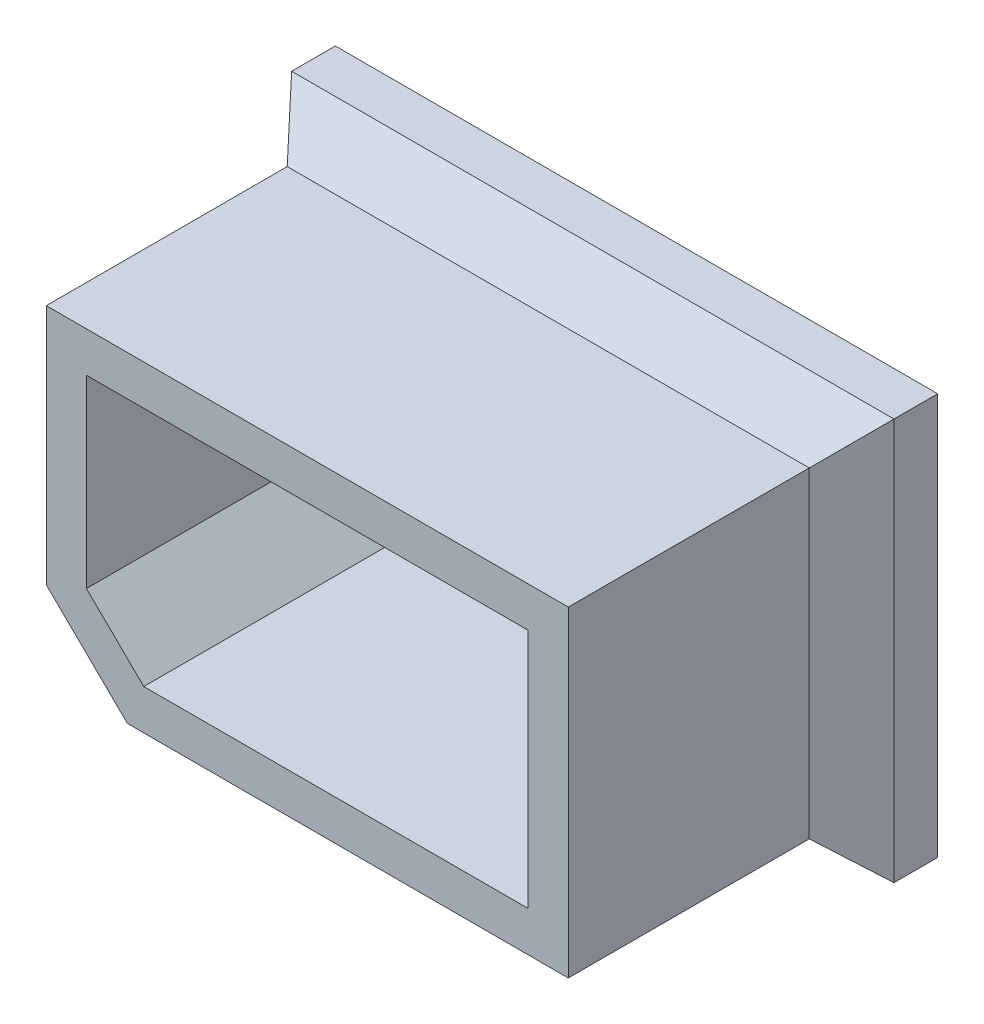
ISO-10303-21;
HEADER;
FILE_DESCRIPTION(('STEP AP214'),'2;1');
FILE_NAME('part.step','',(''),(''),'','','');
FILE_SCHEMA(('AUTOMOTIVE_DESIGN { 1 0 10303 214 1 1 1 1 }'));
ENDSEC;
DATA;
#1=APPLICATION_CONTEXT('core data for automotive mechanical design processes');
#2=APPLICATION_PROTOCOL_DEFINITION('international standard','automotive_design',2000,#1);
#3=PRODUCT_CONTEXT('',#1,'mechanical');
#4=PRODUCT('Part','Part','',(#3));
#5=PRODUCT_RELATED_PRODUCT_CATEGORY('part','',(#4));
#6=PRODUCT_DEFINITION_FORMATION('','',#4);
#7=PRODUCT_DEFINITION_CONTEXT('part definition',#1,'design');
#8=PRODUCT_DEFINITION('design','',#6,#7);
#9=PRODUCT_DEFINITION_SHAPE('','',#8);
#10=(LENGTH_UNIT() NAMED_UNIT(*) SI_UNIT(.MILLI.,.METRE.));
#11=(NAMED_UNIT(*) PLANE_ANGLE_UNIT() SI_UNIT($,.RADIAN.));
#12=(NAMED_UNIT(*) SI_UNIT($,.STERADIAN.) SOLID_ANGLE_UNIT());
#13=UNCERTAINTY_MEASURE_WITH_UNIT(LENGTH_MEASURE(1.E-05),#10,'distance_accuracy_value','');
#14=(GEOMETRIC_REPRESENTATION_CONTEXT(3) GLOBAL_UNCERTAINTY_ASSIGNED_CONTEXT((#13)) GLOBAL_UNIT_ASSIGNED_CONTEXT((#10,
#11,#12)) REPRESENTATION_CONTEXT('',''));
#15=CARTESIAN_POINT('',(0.,0.,0.));
#16=DIRECTION('',(0.,0.,1.));
#17=DIRECTION('',(1.,0.,0.));
#18=AXIS2_PLACEMENT_3D('',#15,#16,#17);
#19=CARTESIAN_POINT('',(0.,0.,0.));
#20=DIRECTION('',(0.,0.,-1.));
#21=DIRECTION('',(-1.,0.,0.));
#22=AXIS2_PLACEMENT_3D('',#19,#20,#21);
#23=PLANE('',#22);
#24=DIRECTION('',(0.,1.,0.));
#25=VECTOR('',#24,1.);
#26=CARTESIAN_POINT('',(82.55,0.,0.));
#27=LINE('',#26,#25);
#28=CARTESIAN_POINT('',(82.55,0.,0.));
#29=VERTEX_POINT('',#28);
#30=CARTESIAN_POINT('',(82.55,50.8,0.));
#31=VERTEX_POINT('',#30);
#32=EDGE_CURVE('E210',#29,#31,#27,.T.);
#33=ORIENTED_EDGE('',*,*,#32,.T.);
#34=DIRECTION('',(-1.,0.,0.));
#35=VECTOR('',#34,1.);
#36=CARTESIAN_POINT('',(0.,50.8,0.));
#37=LINE('',#36,#35);
#38=CARTESIAN_POINT('',(0.,50.8,0.));
#39=VERTEX_POINT('',#38);
#40=EDGE_CURVE('E212',#31,#39,#37,.T.);
#41=ORIENTED_EDGE('',*,*,#40,.T.);
#42=DIRECTION('',(0.,-1.,0.));
#43=VECTOR('',#42,1.);
#44=CARTESIAN_POINT('',(0.,0.,0.));
#45=LINE('',#44,#43);
#46=CARTESIAN_POINT('',(0.,0.,0.));
#47=VERTEX_POINT('',#46);
#48=EDGE_CURVE('E206',#39,#47,#45,.T.);
#49=ORIENTED_EDGE('',*,*,#48,.T.);
#50=DIRECTION('',(1.,0.,0.));
#51=VECTOR('',#50,1.);
#52=CARTESIAN_POINT('',(0.,0.,0.));
#53=LINE('',#52,#51);
#54=EDGE_CURVE('E208',#47,#29,#53,.T.);
#55=ORIENTED_EDGE('',*,*,#54,.T.);
#56=EDGE_LOOP('',(#33,#41,#49,#55));
#57=FACE_BOUND('',#56,.T.);
#58=DIRECTION('',(1.,0.,0.));
#59=VECTOR('',#58,1.);
#60=CARTESIAN_POINT('',(76.2,44.45,0.));
#61=LINE('',#60,#59);
#62=CARTESIAN_POINT('',(6.35,44.45,0.));
#63=VERTEX_POINT('',#62);
#64=CARTESIAN_POINT('',(76.2,44.45,0.));
#65=VERTEX_POINT('',#64);
#66=EDGE_CURVE('E173',#63,#65,#61,.T.);
#67=ORIENTED_EDGE('',*,*,#66,.T.);
#68=DIRECTION('',(0.,-1.,0.));
#69=VECTOR('',#68,1.);
#70=CARTESIAN_POINT('',(76.2,6.35,0.));
#71=LINE('',#70,#69);
#72=CARTESIAN_POINT('',(76.2,6.35,0.));
#73=VERTEX_POINT('',#72);
#74=EDGE_CURVE('E176',#65,#73,#71,.T.);
#75=ORIENTED_EDGE('',*,*,#74,.T.);
#76=DIRECTION('',(-1.,0.,0.));
#77=VECTOR('',#76,1.);
#78=CARTESIAN_POINT('',(15.4196141042494,6.35,0.));
#79=LINE('',#78,#77);
#80=CARTESIAN_POINT('',(15.4196141042494,6.35,0.));
#81=VERTEX_POINT('',#80);
#82=EDGE_CURVE('E179',#73,#81,#79,.T.);
#83=ORIENTED_EDGE('',*,*,#82,.T.);
#84=DIRECTION('',(-0.714142842854285,0.7,0.));
#85=VECTOR('',#84,1.);
#86=CARTESIAN_POINT('',(6.34999999999999,15.24,0.));
#87=LINE('',#86,#85);
#88=CARTESIAN_POINT('',(6.34999999999999,15.24,0.));
#89=VERTEX_POINT('',#88);
#90=EDGE_CURVE('E182',#81,#89,#87,.T.);
#91=ORIENTED_EDGE('',*,*,#90,.T.);
#92=DIRECTION('',(0.,1.,0.));
#93=VECTOR('',#92,1.);
#94=CARTESIAN_POINT('',(6.35,44.45,0.));
#95=LINE('',#94,#93);
#96=EDGE_CURVE('E160',#89,#63,#95,.T.);
#97=ORIENTED_EDGE('',*,*,#96,.T.);
#98=EDGE_LOOP('',(#67,#75,#83,#91,#97));
#99=FACE_BOUND('',#98,.T.);
#100=ADVANCED_FACE('F43',(#57,#99),#23,.F.);
#101=CARTESIAN_POINT('',(-6.34999999999999,57.15,-12.7));
#102=DIRECTION('',(0.,-1.,0.));
#103=DIRECTION('',(1.,0.,0.));
#104=AXIS2_PLACEMENT_3D('',#101,#102,#103);
#105=PLANE('',#104);
#106=DIRECTION('',(0.,0.,1.));
#107=VECTOR('',#106,1.);
#108=CARTESIAN_POINT('',(-6.34999999999999,57.15,-12.7));
#109=LINE('',#108,#107);
#110=CARTESIAN_POINT('',(-6.34999999999998,57.15,-13.97));
#111=VERTEX_POINT('',#110);
#112=CARTESIAN_POINT('',(-6.34999999999999,57.15,-7.05238946916537));
#113=VERTEX_POINT('',#112);
#114=EDGE_CURVE('E198',#111,#113,#109,.T.);
#115=ORIENTED_EDGE('',*,*,#114,.T.);
#116=DIRECTION('',(1.,0.,0.));
#117=VECTOR('',#116,1.);
#118=CARTESIAN_POINT('',(-6.34999999999999,57.15,-7.05238946916537));
#119=LINE('',#118,#117);
#120=CARTESIAN_POINT('',(88.9,57.15,-7.05238946916537));
#121=VERTEX_POINT('',#120);
#122=EDGE_CURVE('E203',#113,#121,#119,.T.);
#123=ORIENTED_EDGE('',*,*,#122,.T.);
#124=DIRECTION('',(0.,0.,1.));
#125=VECTOR('',#124,1.);
#126=CARTESIAN_POINT('',(88.9,57.15,-12.7));
#127=LINE('',#126,#125);
#128=CARTESIAN_POINT('',(88.9,57.15,-13.97));
#129=VERTEX_POINT('',#128);
#130=EDGE_CURVE('E130',#129,#121,#127,.T.);
#131=ORIENTED_EDGE('',*,*,#130,.F.);
#132=DIRECTION('',(1.,0.,0.));
#133=VECTOR('',#132,1.);
#134=CARTESIAN_POINT('',(-6.34999999999998,57.15,-13.97));
#135=LINE('',#134,#133);
#136=EDGE_CURVE('E145',#111,#129,#135,.T.);
#137=ORIENTED_EDGE('',*,*,#136,.F.);
#138=EDGE_LOOP('',(#115,#123,#131,#137));
#139=FACE_BOUND('',#138,.T.);
#140=ADVANCED_FACE('F242',(#139),#105,.F.);
#141=CARTESIAN_POINT('',(88.9,57.15,-12.7));
#142=DIRECTION('',(-1.,0.,0.));
#143=DIRECTION('',(0.,-1.,0.));
#144=AXIS2_PLACEMENT_3D('',#141,#142,#143);
#145=PLANE('',#144);
#146=ORIENTED_EDGE('',*,*,#130,.T.);
#147=DIRECTION('',(0.,-1.,0.));
#148=VECTOR('',#147,1.);
#149=CARTESIAN_POINT('',(88.9,57.15,-7.05238946916537));
#150=LINE('',#149,#148);
#151=CARTESIAN_POINT('',(88.9,-6.35000000000002,-7.05238946916537));
#152=VERTEX_POINT('',#151);
#153=EDGE_CURVE('E67',#121,#152,#150,.T.);
#154=ORIENTED_EDGE('',*,*,#153,.T.);
#155=DIRECTION('',(0.,0.,1.));
#156=VECTOR('',#155,1.);
#157=CARTESIAN_POINT('',(88.9,-6.35000000000002,-12.7));
#158=LINE('',#157,#156);
#159=CARTESIAN_POINT('',(88.9,-6.35000000000002,-13.97));
#160=VERTEX_POINT('',#159);
#161=EDGE_CURVE('E125',#160,#152,#158,.T.);
#162=ORIENTED_EDGE('',*,*,#161,.F.);
#163=DIRECTION('',(0.,-1.,0.));
#164=VECTOR('',#163,1.);
#165=CARTESIAN_POINT('',(88.9,57.15,-13.97));
#166=LINE('',#165,#164);
#167=EDGE_CURVE('E129',#129,#160,#166,.T.);
#168=ORIENTED_EDGE('',*,*,#167,.F.);
#169=EDGE_LOOP('',(#146,#154,#162,#168));
#170=FACE_BOUND('',#169,.T.);
#171=ADVANCED_FACE('F127',(#170),#145,.F.);
#172=CARTESIAN_POINT('',(88.9,-6.35000000000002,-12.7));
#173=DIRECTION('',(0.,1.,0.));
#174=DIRECTION('',(0.,0.,1.));
#175=AXIS2_PLACEMENT_3D('',#172,#173,#174);
#176=PLANE('',#175);
#177=ORIENTED_EDGE('',*,*,#161,.T.);
#178=DIRECTION('',(-1.,0.,0.));
#179=VECTOR('',#178,1.);
#180=CARTESIAN_POINT('',(88.9,-6.35000000000002,-7.05238946916537));
#181=LINE('',#180,#179);
#182=CARTESIAN_POINT('',(-6.34999999999999,-6.35000000000002,-7.05238946916537));
#183=VERTEX_POINT('',#182);
#184=EDGE_CURVE('E52',#152,#183,#181,.T.);
#185=ORIENTED_EDGE('',*,*,#184,.T.);
#186=DIRECTION('',(0.,0.,1.));
#187=VECTOR('',#186,1.);
#188=CARTESIAN_POINT('',(-6.34999999999999,-6.35000000000002,-12.7));
#189=LINE('',#188,#187);
#190=CARTESIAN_POINT('',(-6.34999999999998,-6.35000000000002,-13.97));
#191=VERTEX_POINT('',#190);
#192=EDGE_CURVE('E131',#191,#183,#189,.T.);
#193=ORIENTED_EDGE('',*,*,#192,.F.);
#194=DIRECTION('',(-1.,0.,0.));
#195=VECTOR('',#194,1.);
#196=CARTESIAN_POINT('',(-6.34999999999998,-6.35000000000002,-13.97));
#197=LINE('',#196,#195);
#198=EDGE_CURVE('E134',#160,#191,#197,.T.);
#199=ORIENTED_EDGE('',*,*,#198,.F.);
#200=EDGE_LOOP('',(#177,#185,#193,#199));
#201=FACE_BOUND('',#200,.T.);
#202=ADVANCED_FACE('F135',(#201),#176,.F.);
#203=CARTESIAN_POINT('',(-6.34999999999999,-6.35000000000002,-12.7));
#204=DIRECTION('',(1.,0.,0.));
#205=DIRECTION('',(0.,0.,-1.));
#206=AXIS2_PLACEMENT_3D('',#203,#204,#205);
#207=PLANE('',#206);
#208=ORIENTED_EDGE('',*,*,#192,.T.);
#209=DIRECTION('',(0.,1.,0.));
#210=VECTOR('',#209,1.);
#211=CARTESIAN_POINT('',(-6.34999999999999,-6.35000000000002,-7.05238946916537));
#212=LINE('',#211,#210);
#213=EDGE_CURVE('E12',#183,#113,#212,.T.);
#214=ORIENTED_EDGE('',*,*,#213,.T.);
#215=ORIENTED_EDGE('',*,*,#114,.F.);
#216=DIRECTION('',(0.,1.,0.));
#217=VECTOR('',#216,1.);
#218=CARTESIAN_POINT('',(-6.34999999999998,57.15,-13.97));
#219=LINE('',#218,#217);
#220=EDGE_CURVE('E139',#191,#111,#219,.T.);
#221=ORIENTED_EDGE('',*,*,#220,.F.);
#222=EDGE_LOOP('',(#208,#214,#215,#221));
#223=FACE_BOUND('',#222,.T.);
#224=ADVANCED_FACE('F244',(#223),#207,.F.);
#225=CARTESIAN_POINT('',(76.2,44.45,-12.7));
#226=DIRECTION('',(0.,-1.,0.));
#227=DIRECTION('',(0.,0.,-1.));
#228=AXIS2_PLACEMENT_3D('',#225,#226,#227);
#229=PLANE('',#228);
#230=ORIENTED_EDGE('',*,*,#66,.F.);
#231=DIRECTION('',(0.,0.,1.));
#232=VECTOR('',#231,1.);
#233=CARTESIAN_POINT('',(6.35,44.45,-12.7));
#234=LINE('',#233,#232);
#235=CARTESIAN_POINT('',(6.35,44.45,-12.7));
#236=VERTEX_POINT('',#235);
#237=EDGE_CURVE('E172',#236,#63,#234,.T.);
#238=ORIENTED_EDGE('',*,*,#237,.F.);
#239=DIRECTION('',(1.,0.,0.));
#240=VECTOR('',#239,1.);
#241=CARTESIAN_POINT('',(76.2,44.45,-12.7));
#242=LINE('',#241,#240);
#243=CARTESIAN_POINT('',(76.2,44.45,-12.7));
#244=VERTEX_POINT('',#243);
#245=EDGE_CURVE('E156',#236,#244,#242,.T.);
#246=ORIENTED_EDGE('',*,*,#245,.T.);
#247=DIRECTION('',(0.,0.,1.));
#248=VECTOR('',#247,1.);
#249=CARTESIAN_POINT('',(76.2,44.45,-12.7));
#250=LINE('',#249,#248);
#251=EDGE_CURVE('E195',#244,#65,#250,.T.);
#252=ORIENTED_EDGE('',*,*,#251,.T.);
#253=EDGE_LOOP('',(#230,#238,#246,#252));
#254=FACE_BOUND('',#253,.T.);
#255=ADVANCED_FACE('F246',(#254),#229,.T.);
#256=CARTESIAN_POINT('',(76.2,6.35,-12.7));
#257=DIRECTION('',(-1.,0.,0.));
#258=DIRECTION('',(0.,-1.,0.));
#259=AXIS2_PLACEMENT_3D('',#256,#257,#258);
#260=PLANE('',#259);
#261=ORIENTED_EDGE('',*,*,#74,.F.);
#262=ORIENTED_EDGE('',*,*,#251,.F.);
#263=DIRECTION('',(0.,-1.,0.));
#264=VECTOR('',#263,1.);
#265=CARTESIAN_POINT('',(76.2,6.35,-12.7));
#266=LINE('',#265,#264);
#267=CARTESIAN_POINT('',(76.2,6.35,-12.7));
#268=VERTEX_POINT('',#267);
#269=EDGE_CURVE('E159',#244,#268,#266,.T.);
#270=ORIENTED_EDGE('',*,*,#269,.T.);
#271=DIRECTION('',(0.,0.,1.));
#272=VECTOR('',#271,1.);
#273=CARTESIAN_POINT('',(76.2,6.35,-12.7));
#274=LINE('',#273,#272);
#275=EDGE_CURVE('E193',#268,#73,#274,.T.);
#276=ORIENTED_EDGE('',*,*,#275,.T.);
#277=EDGE_LOOP('',(#261,#262,#270,#276));
#278=FACE_BOUND('',#277,.T.);
#279=ADVANCED_FACE('F252',(#278),#260,.T.);
#280=CARTESIAN_POINT('',(15.4196141042494,6.35,-12.7));
#281=DIRECTION('',(0.,1.,0.));
#282=DIRECTION('',(0.,0.,1.));
#283=AXIS2_PLACEMENT_3D('',#280,#281,#282);
#284=PLANE('',#283);
#285=ORIENTED_EDGE('',*,*,#82,.F.);
#286=ORIENTED_EDGE('',*,*,#275,.F.);
#287=DIRECTION('',(-1.,0.,0.));
#288=VECTOR('',#287,1.);
#289=CARTESIAN_POINT('',(15.4196141042494,6.35,-12.7));
#290=LINE('',#289,#288);
#291=CARTESIAN_POINT('',(15.4196141042494,6.35,-12.7));
#292=VERTEX_POINT('',#291);
#293=EDGE_CURVE('E163',#268,#292,#290,.T.);
#294=ORIENTED_EDGE('',*,*,#293,.T.);
#295=DIRECTION('',(0.,0.,1.));
#296=VECTOR('',#295,1.);
#297=CARTESIAN_POINT('',(15.4196141042494,6.35,-12.7));
#298=LINE('',#297,#296);
#299=EDGE_CURVE('E191',#292,#81,#298,.T.);
#300=ORIENTED_EDGE('',*,*,#299,.T.);
#301=EDGE_LOOP('',(#285,#286,#294,#300));
#302=FACE_BOUND('',#301,.T.);
#303=ADVANCED_FACE('F265',(#302),#284,.T.);
#304=CARTESIAN_POINT('',(6.34999999999999,15.24,-12.7));
#305=DIRECTION('',(0.7,0.714142842854285,0.));
#306=DIRECTION('',(-0.714142842854285,0.7,0.));
#307=AXIS2_PLACEMENT_3D('',#304,#305,#306);
#308=PLANE('',#307);
#309=ORIENTED_EDGE('',*,*,#90,.F.);
#310=ORIENTED_EDGE('',*,*,#299,.F.);
#311=DIRECTION('',(-0.714142842854285,0.7,0.));
#312=VECTOR('',#311,1.);
#313=CARTESIAN_POINT('',(6.34999999999999,15.24,-12.7));
#314=LINE('',#313,#312);
#315=CARTESIAN_POINT('',(6.34999999999999,15.24,-12.7));
#316=VERTEX_POINT('',#315);
#317=EDGE_CURVE('E166',#292,#316,#314,.T.);
#318=ORIENTED_EDGE('',*,*,#317,.T.);
#319=DIRECTION('',(0.,0.,1.));
#320=VECTOR('',#319,1.);
#321=CARTESIAN_POINT('',(6.34999999999999,15.24,-12.7));
#322=LINE('',#321,#320);
#323=EDGE_CURVE('E189',#316,#89,#322,.T.);
#324=ORIENTED_EDGE('',*,*,#323,.T.);
#325=EDGE_LOOP('',(#309,#310,#318,#324));
#326=FACE_BOUND('',#325,.T.);
#327=ADVANCED_FACE('F269',(#326),#308,.T.);
#328=CARTESIAN_POINT('',(6.35,44.45,-12.7));
#329=DIRECTION('',(1.,0.,0.));
#330=DIRECTION('',(0.,1.,0.));
#331=AXIS2_PLACEMENT_3D('',#328,#329,#330);
#332=PLANE('',#331);
#333=ORIENTED_EDGE('',*,*,#96,.F.);
#334=ORIENTED_EDGE('',*,*,#323,.F.);
#335=DIRECTION('',(0.,1.,0.));
#336=VECTOR('',#335,1.);
#337=CARTESIAN_POINT('',(6.35,44.45,-12.7));
#338=LINE('',#337,#336);
#339=EDGE_CURVE('E169',#316,#236,#338,.T.);
#340=ORIENTED_EDGE('',*,*,#339,.T.);
#341=ORIENTED_EDGE('',*,*,#237,.T.);
#342=EDGE_LOOP('',(#333,#334,#340,#341));
#343=FACE_BOUND('',#342,.T.);
#344=ADVANCED_FACE('F273',(#343),#332,.T.);
#345=CARTESIAN_POINT('',(88.9,-6.35000000000002,-7.05238946916537));
#346=DIRECTION('',(0.,0.743144825477393,-0.669130606358859));
#347=DIRECTION('',(-1.,0.,0.));
#348=AXIS2_PLACEMENT_3D('',#345,#346,#347);
#349=PLANE('',#348);
#350=DIRECTION('',(-0.556117091816005,0.556117091816005,0.617630601881269));
#351=VECTOR('',#350,1.);
#352=CARTESIAN_POINT('',(88.9,-6.35000000000002,-7.05238946916537));
#353=LINE('',#352,#351);
#354=EDGE_CURVE('E219',#29,#152,#353,.F.);
#355=ORIENTED_EDGE('',*,*,#354,.F.);
#356=ORIENTED_EDGE('',*,*,#54,.F.);
#357=DIRECTION('',(0.556117091816005,0.556117091816005,0.617630601881269));
#358=VECTOR('',#357,1.);
#359=CARTESIAN_POINT('',(-6.34999999999999,-6.35000000000002,-7.05238946916537));
#360=LINE('',#359,#358);
#361=EDGE_CURVE('E47',#183,#47,#360,.T.);
#362=ORIENTED_EDGE('',*,*,#361,.F.);
#363=ORIENTED_EDGE('',*,*,#184,.F.);
#364=EDGE_LOOP('',(#355,#356,#362,#363));
#365=FACE_BOUND('',#364,.T.);
#366=ADVANCED_FACE('F45',(#365),#349,.F.);
#367=CARTESIAN_POINT('',(-6.34999999999999,-6.35000000000002,-7.05238946916537));
#368=DIRECTION('',(0.743144825477393,0.,-0.669130606358859));
#369=DIRECTION('',(0.,1.,0.));
#370=AXIS2_PLACEMENT_3D('',#367,#368,#369);
#371=PLANE('',#370);
#372=ORIENTED_EDGE('',*,*,#361,.T.);
#373=ORIENTED_EDGE('',*,*,#48,.F.);
#374=DIRECTION('',(-0.556117091816005,0.556117091816005,-0.617630601881269));
#375=VECTOR('',#374,1.);
#376=CARTESIAN_POINT('',(13.2884049579281,37.5115950420719,14.7582688483932));
#377=LINE('',#376,#375);
#378=EDGE_CURVE('E218',#113,#39,#377,.F.);
#379=ORIENTED_EDGE('',*,*,#378,.F.);
#380=ORIENTED_EDGE('',*,*,#213,.F.);
#381=EDGE_LOOP('',(#372,#373,#379,#380));
#382=FACE_BOUND('',#381,.T.);
#383=ADVANCED_FACE('F229',(#382),#371,.F.);
#384=CARTESIAN_POINT('',(88.9,57.15,-7.05238946916537));
#385=DIRECTION('',(-0.743144825477393,0.,-0.669130606358859));
#386=DIRECTION('',(0.,-1.,0.));
#387=AXIS2_PLACEMENT_3D('',#384,#385,#386);
#388=PLANE('',#387);
#389=ORIENTED_EDGE('',*,*,#354,.T.);
#390=ORIENTED_EDGE('',*,*,#153,.F.);
#391=DIRECTION('',(-0.556117091816005,-0.556117091816005,0.617630601881269));
#392=VECTOR('',#391,1.);
#393=CARTESIAN_POINT('',(88.9,57.15,-7.05238946916537));
#394=LINE('',#393,#392);
#395=EDGE_CURVE('E155',#31,#121,#394,.F.);
#396=ORIENTED_EDGE('',*,*,#395,.F.);
#397=ORIENTED_EDGE('',*,*,#32,.F.);
#398=EDGE_LOOP('',(#389,#390,#396,#397));
#399=FACE_BOUND('',#398,.T.);
#400=ADVANCED_FACE('F240',(#399),#388,.F.);
#401=CARTESIAN_POINT('',(-6.34999999999999,57.15,-7.05238946916537));
#402=DIRECTION('',(0.,-0.743144825477393,-0.669130606358859));
#403=DIRECTION('',(1.,0.,0.));
#404=AXIS2_PLACEMENT_3D('',#401,#402,#403);
#405=PLANE('',#404);
#406=ORIENTED_EDGE('',*,*,#378,.T.);
#407=ORIENTED_EDGE('',*,*,#40,.F.);
#408=ORIENTED_EDGE('',*,*,#395,.T.);
#409=ORIENTED_EDGE('',*,*,#122,.F.);
#410=EDGE_LOOP('',(#406,#407,#408,#409));
#411=FACE_BOUND('',#410,.T.);
#412=ADVANCED_FACE('F238',(#411),#405,.F.);
#413=CARTESIAN_POINT('',(0.,0.,-12.7));
#414=DIRECTION('',(0.,0.,1.));
#415=DIRECTION('',(1.,0.,0.));
#416=AXIS2_PLACEMENT_3D('',#413,#414,#415);
#417=PLANE('',#416);
#418=CARTESIAN_POINT('',(41.275,25.4,-12.7));
#419=DIRECTION('',(0.,0.,-1.));
#420=DIRECTION('',(-1.,0.,0.));
#421=AXIS2_PLACEMENT_3D('',#418,#419,#420);
#422=CIRCLE('',#421,9.906);
#423=CARTESIAN_POINT('',(31.369,25.4,-12.7));
#424=VERTEX_POINT('',#423);
#425=EDGE_CURVE('E149',#424,#424,#422,.T.);
#426=ORIENTED_EDGE('',*,*,#425,.T.);
#427=EDGE_LOOP('',(#426));
#428=FACE_BOUND('',#427,.T.);
#429=ORIENTED_EDGE('',*,*,#269,.F.);
#430=ORIENTED_EDGE('',*,*,#245,.F.);
#431=ORIENTED_EDGE('',*,*,#339,.F.);
#432=ORIENTED_EDGE('',*,*,#317,.F.);
#433=ORIENTED_EDGE('',*,*,#293,.F.);
#434=EDGE_LOOP('',(#429,#430,#431,#432,#433));
#435=FACE_BOUND('',#434,.T.);
#436=ADVANCED_FACE('F278',(#428,#435),#417,.T.);
#437=CARTESIAN_POINT('',(0.,0.,-13.97));
#438=DIRECTION('',(0.,0.,1.));
#439=DIRECTION('',(1.,0.,0.));
#440=AXIS2_PLACEMENT_3D('',#437,#438,#439);
#441=PLANE('',#440);
#442=ORIENTED_EDGE('',*,*,#167,.T.);
#443=ORIENTED_EDGE('',*,*,#198,.T.);
#444=ORIENTED_EDGE('',*,*,#220,.T.);
#445=ORIENTED_EDGE('',*,*,#136,.T.);
#446=EDGE_LOOP('',(#442,#443,#444,#445));
#447=FACE_BOUND('',#446,.T.);
#448=CARTESIAN_POINT('',(41.275,25.4,-13.97));
#449=DIRECTION('',(0.,0.,-1.));
#450=DIRECTION('',(-1.,0.,0.));
#451=AXIS2_PLACEMENT_3D('',#448,#449,#450);
#452=CIRCLE('',#451,9.906);
#453=CARTESIAN_POINT('',(31.369,25.4,-13.97));
#454=VERTEX_POINT('',#453);
#455=EDGE_CURVE('E146',#454,#454,#452,.T.);
#456=ORIENTED_EDGE('',*,*,#455,.F.);
#457=EDGE_LOOP('',(#456));
#458=FACE_BOUND('',#457,.T.);
#459=ADVANCED_FACE('F142',(#447,#458),#441,.F.);
#460=CARTESIAN_POINT('',(41.275,25.4,-13.97));
#461=DIRECTION('',(0.,0.,1.));
#462=DIRECTION('',(1.,0.,0.));
#463=AXIS2_PLACEMENT_3D('',#460,#461,#462);
#464=CYLINDRICAL_SURFACE('',#463,9.906);
#465=ORIENTED_EDGE('',*,*,#455,.T.);
#466=EDGE_LOOP('',(#465));
#467=FACE_BOUND('',#466,.T.);
#468=ORIENTED_EDGE('',*,*,#425,.F.);
#469=EDGE_LOOP('',(#468));
#470=FACE_BOUND('',#469,.T.);
#471=ADVANCED_FACE('F284',(#467,#470),#464,.F.);
#472=CLOSED_SHELL('',(#100,#140,#171,#202,#224,#255,#279,#303,#327,#344,#366,#383,#400,#412,
#436,#459,#471));
#473=MANIFOLD_SOLID_BREP('B2',#472);
#474=CARTESIAN_POINT('',(0.,0.,38.1));
#475=DIRECTION('',(0.,0.,1.));
#476=DIRECTION('',(1.,0.,0.));
#477=AXIS2_PLACEMENT_3D('',#474,#475,#476);
#478=PLANE('',#477);
#479=DIRECTION('',(0.,-1.,0.));
#480=VECTOR('',#479,1.);
#481=CARTESIAN_POINT('',(0.,50.8,38.1));
#482=LINE('',#481,#480);
#483=CARTESIAN_POINT('',(0.,50.8,38.1));
#484=VERTEX_POINT('',#483);
#485=CARTESIAN_POINT('',(0.,12.5724664399266,38.1));
#486=VERTEX_POINT('',#485);
#487=EDGE_CURVE('E542',#484,#486,#482,.T.);
#488=ORIENTED_EDGE('',*,*,#487,.T.);
#489=DIRECTION('',(0.714142842854285,-0.7,0.));
#490=VECTOR('',#489,1.);
#491=CARTESIAN_POINT('',(0.,12.5724664399266,38.1));
#492=LINE('',#491,#490);
#493=CARTESIAN_POINT('',(12.8264813215704,0.,38.1));
#494=VERTEX_POINT('',#493);
#495=EDGE_CURVE('E545',#486,#494,#492,.T.);
#496=ORIENTED_EDGE('',*,*,#495,.T.);
#497=DIRECTION('',(1.,0.,0.));
#498=VECTOR('',#497,1.);
#499=CARTESIAN_POINT('',(12.8264813215704,0.,38.1));
#500=LINE('',#499,#498);
#501=CARTESIAN_POINT('',(82.55,0.,38.1));
#502=VERTEX_POINT('',#501);
#503=EDGE_CURVE('E548',#494,#502,#500,.T.);
#504=ORIENTED_EDGE('',*,*,#503,.T.);
#505=DIRECTION('',(0.,1.,0.));
#506=VECTOR('',#505,1.);
#507=CARTESIAN_POINT('',(82.55,50.8,38.1));
#508=LINE('',#507,#506);
#509=CARTESIAN_POINT('',(82.55,50.8,38.1));
#510=VERTEX_POINT('',#509);
#511=EDGE_CURVE('E550',#502,#510,#508,.T.);
#512=ORIENTED_EDGE('',*,*,#511,.T.);
#513=DIRECTION('',(-1.,0.,0.));
#514=VECTOR('',#513,1.);
#515=CARTESIAN_POINT('',(0.,50.8,38.1));
#516=LINE('',#515,#514);
#517=EDGE_CURVE('E552',#510,#484,#516,.T.);
#518=ORIENTED_EDGE('',*,*,#517,.T.);
#519=EDGE_LOOP('',(#488,#496,#504,#512,#518));
#520=FACE_BOUND('',#519,.T.);
#521=DIRECTION('',(1.,0.,0.));
#522=VECTOR('',#521,1.);
#523=CARTESIAN_POINT('',(76.2,6.35,38.1));
#524=LINE('',#523,#522);
#525=CARTESIAN_POINT('',(15.4196141042494,6.35,38.1));
#526=VERTEX_POINT('',#525);
#527=CARTESIAN_POINT('',(76.2,6.35,38.1));
#528=VERTEX_POINT('',#527);
#529=EDGE_CURVE('E506',#526,#528,#524,.T.);
#530=ORIENTED_EDGE('',*,*,#529,.F.);
#531=DIRECTION('',(0.714142842854285,-0.7,0.));
#532=VECTOR('',#531,1.);
#533=CARTESIAN_POINT('',(15.4196141042494,6.35,38.1));
#534=LINE('',#533,#532);
#535=CARTESIAN_POINT('',(6.34999999999999,15.24,38.1));
#536=VERTEX_POINT('',#535);
#537=EDGE_CURVE('E498',#536,#526,#534,.T.);
#538=ORIENTED_EDGE('',*,*,#537,.F.);
#539=DIRECTION('',(0.,-1.,0.));
#540=VECTOR('',#539,1.);
#541=CARTESIAN_POINT('',(6.34999999999999,15.24,38.1));
#542=LINE('',#541,#540);
#543=CARTESIAN_POINT('',(6.35,44.45,38.1));
#544=VERTEX_POINT('',#543);
#545=EDGE_CURVE('E525',#544,#536,#542,.T.);
#546=ORIENTED_EDGE('',*,*,#545,.F.);
#547=DIRECTION('',(-1.,0.,0.));
#548=VECTOR('',#547,1.);
#549=CARTESIAN_POINT('',(6.35,44.45,38.1));
#550=LINE('',#549,#548);
#551=CARTESIAN_POINT('',(76.2,44.45,38.1));
#552=VERTEX_POINT('',#551);
#553=EDGE_CURVE('E521',#552,#544,#550,.T.);
#554=ORIENTED_EDGE('',*,*,#553,.F.);
#555=DIRECTION('',(0.,1.,0.));
#556=VECTOR('',#555,1.);
#557=CARTESIAN_POINT('',(76.2,44.45,38.1));
#558=LINE('',#557,#556);
#559=EDGE_CURVE('E519',#528,#552,#558,.T.);
#560=ORIENTED_EDGE('',*,*,#559,.F.);
#561=EDGE_LOOP('',(#530,#538,#546,#554,#560));
#562=FACE_BOUND('',#561,.T.);
#563=ADVANCED_FACE('F421',(#520,#562),#478,.T.);
#564=CARTESIAN_POINT('',(0.,0.,0.));
#565=DIRECTION('',(0.,0.,1.));
#566=DIRECTION('',(1.,0.,0.));
#567=AXIS2_PLACEMENT_3D('',#564,#565,#566);
#568=PLANE('',#567);
#569=DIRECTION('',(0.,-1.,0.));
#570=VECTOR('',#569,1.);
#571=CARTESIAN_POINT('',(0.,50.8,0.));
#572=LINE('',#571,#570);
#573=CARTESIAN_POINT('',(0.,50.8,0.));
#574=VERTEX_POINT('',#573);
#575=CARTESIAN_POINT('',(0.,12.5724664399266,0.));
#576=VERTEX_POINT('',#575);
#577=EDGE_CURVE('E514',#574,#576,#572,.T.);
#578=ORIENTED_EDGE('',*,*,#577,.F.);
#579=DIRECTION('',(-1.,0.,0.));
#580=VECTOR('',#579,1.);
#581=CARTESIAN_POINT('',(0.,50.8,0.));
#582=LINE('',#581,#580);
#583=CARTESIAN_POINT('',(82.55,50.8,0.));
#584=VERTEX_POINT('',#583);
#585=EDGE_CURVE('E546',#584,#574,#582,.T.);
#586=ORIENTED_EDGE('',*,*,#585,.F.);
#587=DIRECTION('',(0.,1.,0.));
#588=VECTOR('',#587,1.);
#589=CARTESIAN_POINT('',(82.55,50.8,0.));
#590=LINE('',#589,#588);
#591=CARTESIAN_POINT('',(82.55,0.,0.));
#592=VERTEX_POINT('',#591);
#593=EDGE_CURVE('E561',#592,#584,#590,.T.);
#594=ORIENTED_EDGE('',*,*,#593,.F.);
#595=DIRECTION('',(1.,0.,0.));
#596=VECTOR('',#595,1.);
#597=CARTESIAN_POINT('',(12.8264813215704,0.,0.));
#598=LINE('',#597,#596);
#599=CARTESIAN_POINT('',(12.8264813215704,0.,0.));
#600=VERTEX_POINT('',#599);
#601=EDGE_CURVE('E559',#600,#592,#598,.T.);
#602=ORIENTED_EDGE('',*,*,#601,.F.);
#603=DIRECTION('',(0.714142842854285,-0.7,0.));
#604=VECTOR('',#603,1.);
#605=CARTESIAN_POINT('',(0.,12.5724664399266,0.));
#606=LINE('',#605,#604);
#607=EDGE_CURVE('E557',#576,#600,#606,.T.);
#608=ORIENTED_EDGE('',*,*,#607,.F.);
#609=EDGE_LOOP('',(#578,#586,#594,#602,#608));
#610=FACE_BOUND('',#609,.T.);
#611=DIRECTION('',(0.714142842854285,-0.7,0.));
#612=VECTOR('',#611,1.);
#613=CARTESIAN_POINT('',(15.4196141042494,6.35,0.));
#614=LINE('',#613,#612);
#615=CARTESIAN_POINT('',(6.34999999999999,15.24,0.));
#616=VERTEX_POINT('',#615);
#617=CARTESIAN_POINT('',(15.4196141042494,6.35,0.));
#618=VERTEX_POINT('',#617);
#619=EDGE_CURVE('E444',#616,#618,#614,.T.);
#620=ORIENTED_EDGE('',*,*,#619,.T.);
#621=DIRECTION('',(1.,0.,0.));
#622=VECTOR('',#621,1.);
#623=CARTESIAN_POINT('',(76.2,6.35,0.));
#624=LINE('',#623,#622);
#625=CARTESIAN_POINT('',(76.2,6.35,0.));
#626=VERTEX_POINT('',#625);
#627=EDGE_CURVE('E513',#618,#626,#624,.T.);
#628=ORIENTED_EDGE('',*,*,#627,.T.);
#629=DIRECTION('',(0.,1.,0.));
#630=VECTOR('',#629,1.);
#631=CARTESIAN_POINT('',(76.2,44.45,0.));
#632=LINE('',#631,#630);
#633=CARTESIAN_POINT('',(76.2,44.45,0.));
#634=VERTEX_POINT('',#633);
#635=EDGE_CURVE('E529',#626,#634,#632,.T.);
#636=ORIENTED_EDGE('',*,*,#635,.T.);
#637=DIRECTION('',(-1.,0.,0.));
#638=VECTOR('',#637,1.);
#639=CARTESIAN_POINT('',(6.35,44.45,0.));
#640=LINE('',#639,#638);
#641=CARTESIAN_POINT('',(6.35,44.45,0.));
#642=VERTEX_POINT('',#641);
#643=EDGE_CURVE('E532',#634,#642,#640,.T.);
#644=ORIENTED_EDGE('',*,*,#643,.T.);
#645=DIRECTION('',(0.,-1.,0.));
#646=VECTOR('',#645,1.);
#647=CARTESIAN_POINT('',(6.34999999999999,15.24,0.));
#648=LINE('',#647,#646);
#649=EDGE_CURVE('E507',#642,#616,#648,.T.);
#650=ORIENTED_EDGE('',*,*,#649,.T.);
#651=EDGE_LOOP('',(#620,#628,#636,#644,#650));
#652=FACE_BOUND('',#651,.T.);
#653=ADVANCED_FACE('F582',(#610,#652),#568,.F.);
#654=CARTESIAN_POINT('',(0.,50.8,38.1));
#655=DIRECTION('',(1.,0.,0.));
#656=DIRECTION('',(0.,1.,0.));
#657=AXIS2_PLACEMENT_3D('',#654,#655,#656);
#658=PLANE('',#657);
#659=ORIENTED_EDGE('',*,*,#577,.T.);
#660=DIRECTION('',(0.,0.,-1.));
#661=VECTOR('',#660,1.);
#662=CARTESIAN_POINT('',(0.,12.5724664399266,38.1));
#663=LINE('',#662,#661);
#664=EDGE_CURVE('E41',#486,#576,#663,.T.);
#665=ORIENTED_EDGE('',*,*,#664,.F.);
#666=ORIENTED_EDGE('',*,*,#487,.F.);
#667=DIRECTION('',(0.,0.,-1.));
#668=VECTOR('',#667,1.);
#669=CARTESIAN_POINT('',(0.,50.8,38.1));
#670=LINE('',#669,#668);
#671=EDGE_CURVE('E554',#484,#574,#670,.T.);
#672=ORIENTED_EDGE('',*,*,#671,.T.);
#673=EDGE_LOOP('',(#659,#665,#666,#672));
#674=FACE_BOUND('',#673,.T.);
#675=ADVANCED_FACE('F423',(#674),#658,.F.);
#676=CARTESIAN_POINT('',(0.,12.5724664399266,38.1));
#677=DIRECTION('',(0.7,0.714142842854285,0.));
#678=DIRECTION('',(-0.714142842854285,0.7,0.));
#679=AXIS2_PLACEMENT_3D('',#676,#677,#678);
#680=PLANE('',#679);
#681=ORIENTED_EDGE('',*,*,#607,.T.);
#682=DIRECTION('',(0.,0.,-1.));
#683=VECTOR('',#682,1.);
#684=CARTESIAN_POINT('',(12.8264813215704,0.,38.1));
#685=LINE('',#684,#683);
#686=EDGE_CURVE('E429',#494,#600,#685,.T.);
#687=ORIENTED_EDGE('',*,*,#686,.F.);
#688=ORIENTED_EDGE('',*,*,#495,.F.);
#689=ORIENTED_EDGE('',*,*,#664,.T.);
#690=EDGE_LOOP('',(#681,#687,#688,#689));
#691=FACE_BOUND('',#690,.T.);
#692=ADVANCED_FACE('F596',(#691),#680,.F.);
#693=CARTESIAN_POINT('',(12.8264813215704,0.,38.1));
#694=DIRECTION('',(0.,1.,0.));
#695=DIRECTION('',(-1.,0.,0.));
#696=AXIS2_PLACEMENT_3D('',#693,#694,#695);
#697=PLANE('',#696);
#698=ORIENTED_EDGE('',*,*,#601,.T.);
#699=DIRECTION('',(0.,0.,-1.));
#700=VECTOR('',#699,1.);
#701=CARTESIAN_POINT('',(82.55,0.,38.1));
#702=LINE('',#701,#700);
#703=EDGE_CURVE('E569',#502,#592,#702,.T.);
#704=ORIENTED_EDGE('',*,*,#703,.F.);
#705=ORIENTED_EDGE('',*,*,#503,.F.);
#706=ORIENTED_EDGE('',*,*,#686,.T.);
#707=EDGE_LOOP('',(#698,#704,#705,#706));
#708=FACE_BOUND('',#707,.T.);
#709=ADVANCED_FACE('F576',(#708),#697,.F.);
#710=CARTESIAN_POINT('',(82.55,50.8,38.1));
#711=DIRECTION('',(-1.,0.,0.));
#712=DIRECTION('',(0.,0.,1.));
#713=AXIS2_PLACEMENT_3D('',#710,#711,#712);
#714=PLANE('',#713);
#715=ORIENTED_EDGE('',*,*,#593,.T.);
#716=DIRECTION('',(0.,0.,-1.));
#717=VECTOR('',#716,1.);
#718=CARTESIAN_POINT('',(82.55,50.8,38.1));
#719=LINE('',#718,#717);
#720=EDGE_CURVE('E566',#510,#584,#719,.T.);
#721=ORIENTED_EDGE('',*,*,#720,.F.);
#722=ORIENTED_EDGE('',*,*,#511,.F.);
#723=ORIENTED_EDGE('',*,*,#703,.T.);
#724=EDGE_LOOP('',(#715,#721,#722,#723));
#725=FACE_BOUND('',#724,.T.);
#726=ADVANCED_FACE('F587',(#725),#714,.F.);
#727=CARTESIAN_POINT('',(0.,50.8,38.1));
#728=DIRECTION('',(0.,-1.,0.));
#729=DIRECTION('',(0.,0.,-1.));
#730=AXIS2_PLACEMENT_3D('',#727,#728,#729);
#731=PLANE('',#730);
#732=ORIENTED_EDGE('',*,*,#585,.T.);
#733=ORIENTED_EDGE('',*,*,#671,.F.);
#734=ORIENTED_EDGE('',*,*,#517,.F.);
#735=ORIENTED_EDGE('',*,*,#720,.T.);
#736=EDGE_LOOP('',(#732,#733,#734,#735));
#737=FACE_BOUND('',#736,.T.);
#738=ADVANCED_FACE('F591',(#737),#731,.F.);
#739=CARTESIAN_POINT('',(15.4196141042494,6.35,38.1));
#740=DIRECTION('',(0.7,0.714142842854285,0.));
#741=DIRECTION('',(-0.714142842854285,0.7,0.));
#742=AXIS2_PLACEMENT_3D('',#739,#740,#741);
#743=PLANE('',#742);
#744=ORIENTED_EDGE('',*,*,#619,.F.);
#745=DIRECTION('',(0.,0.,-1.));
#746=VECTOR('',#745,1.);
#747=CARTESIAN_POINT('',(6.34999999999999,15.24,38.1));
#748=LINE('',#747,#746);
#749=EDGE_CURVE('E502',#536,#616,#748,.T.);
#750=ORIENTED_EDGE('',*,*,#749,.F.);
#751=ORIENTED_EDGE('',*,*,#537,.T.);
#752=DIRECTION('',(0.,0.,-1.));
#753=VECTOR('',#752,1.);
#754=CARTESIAN_POINT('',(15.4196141042494,6.35,38.1));
#755=LINE('',#754,#753);
#756=EDGE_CURVE('E501',#526,#618,#755,.T.);
#757=ORIENTED_EDGE('',*,*,#756,.T.);
#758=EDGE_LOOP('',(#744,#750,#751,#757));
#759=FACE_BOUND('',#758,.T.);
#760=ADVANCED_FACE('F500',(#759),#743,.T.);
#761=CARTESIAN_POINT('',(76.2,6.35,38.1));
#762=DIRECTION('',(0.,1.,0.));
#763=DIRECTION('',(0.,0.,1.));
#764=AXIS2_PLACEMENT_3D('',#761,#762,#763);
#765=PLANE('',#764);
#766=ORIENTED_EDGE('',*,*,#627,.F.);
#767=ORIENTED_EDGE('',*,*,#756,.F.);
#768=ORIENTED_EDGE('',*,*,#529,.T.);
#769=DIRECTION('',(0.,0.,-1.));
#770=VECTOR('',#769,1.);
#771=CARTESIAN_POINT('',(76.2,6.35,38.1));
#772=LINE('',#771,#770);
#773=EDGE_CURVE('E515',#528,#626,#772,.T.);
#774=ORIENTED_EDGE('',*,*,#773,.T.);
#775=EDGE_LOOP('',(#766,#767,#768,#774));
#776=FACE_BOUND('',#775,.T.);
#777=ADVANCED_FACE('F510',(#776),#765,.T.);
#778=CARTESIAN_POINT('',(76.2,44.45,38.1));
#779=DIRECTION('',(-1.,0.,0.));
#780=DIRECTION('',(0.,-1.,0.));
#781=AXIS2_PLACEMENT_3D('',#778,#779,#780);
#782=PLANE('',#781);
#783=ORIENTED_EDGE('',*,*,#635,.F.);
#784=ORIENTED_EDGE('',*,*,#773,.F.);
#785=ORIENTED_EDGE('',*,*,#559,.T.);
#786=DIRECTION('',(0.,0.,-1.));
#787=VECTOR('',#786,1.);
#788=CARTESIAN_POINT('',(76.2,44.45,38.1));
#789=LINE('',#788,#787);
#790=EDGE_CURVE('E539',#552,#634,#789,.T.);
#791=ORIENTED_EDGE('',*,*,#790,.T.);
#792=EDGE_LOOP('',(#783,#784,#785,#791));
#793=FACE_BOUND('',#792,.T.);
#794=ADVANCED_FACE('F639',(#793),#782,.T.);
#795=CARTESIAN_POINT('',(6.35,44.45,38.1));
#796=DIRECTION('',(0.,-1.,0.));
#797=DIRECTION('',(0.,0.,-1.));
#798=AXIS2_PLACEMENT_3D('',#795,#796,#797);
#799=PLANE('',#798);
#800=ORIENTED_EDGE('',*,*,#643,.F.);
#801=ORIENTED_EDGE('',*,*,#790,.F.);
#802=ORIENTED_EDGE('',*,*,#553,.T.);
#803=DIRECTION('',(0.,0.,-1.));
#804=VECTOR('',#803,1.);
#805=CARTESIAN_POINT('',(6.35,44.45,38.1));
#806=LINE('',#805,#804);
#807=EDGE_CURVE('E436',#544,#642,#806,.T.);
#808=ORIENTED_EDGE('',*,*,#807,.T.);
#809=EDGE_LOOP('',(#800,#801,#802,#808));
#810=FACE_BOUND('',#809,.T.);
#811=ADVANCED_FACE('F645',(#810),#799,.T.);
#812=CARTESIAN_POINT('',(6.34999999999999,15.24,38.1));
#813=DIRECTION('',(1.,0.,0.));
#814=DIRECTION('',(0.,1.,0.));
#815=AXIS2_PLACEMENT_3D('',#812,#813,#814);
#816=PLANE('',#815);
#817=ORIENTED_EDGE('',*,*,#649,.F.);
#818=ORIENTED_EDGE('',*,*,#807,.F.);
#819=ORIENTED_EDGE('',*,*,#545,.T.);
#820=ORIENTED_EDGE('',*,*,#749,.T.);
#821=EDGE_LOOP('',(#817,#818,#819,#820));
#822=FACE_BOUND('',#821,.T.);
#823=ADVANCED_FACE('F653',(#822),#816,.T.);
#824=CLOSED_SHELL('',(#563,#653,#675,#692,#709,#726,#738,#760,#777,#794,#811,#823));
#825=MANIFOLD_SOLID_BREP('B6',#824);
#826=ADVANCED_BREP_SHAPE_REPRESENTATION('',(#18,#473,#825),#14);
#827=SHAPE_DEFINITION_REPRESENTATION(#9,#826);
ENDSEC;
END-ISO-10303-21;
